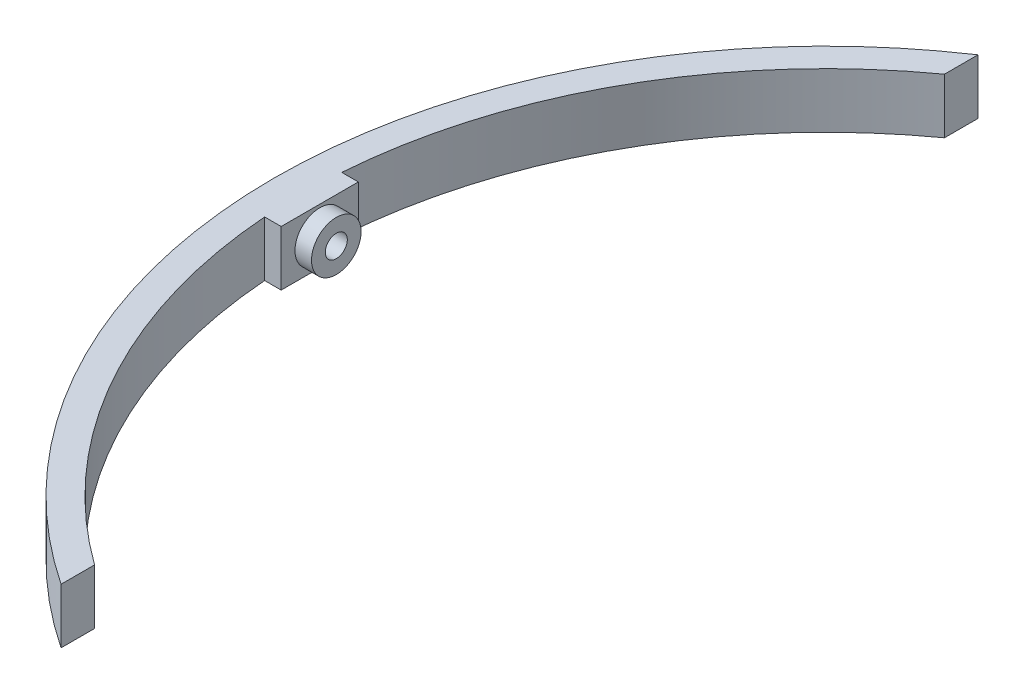
ISO-10303-21;
HEADER;
FILE_DESCRIPTION(('STEP AP214'),'2;1');
FILE_NAME('part.step','',(''),(''),'','','');
FILE_SCHEMA(('AUTOMOTIVE_DESIGN { 1 0 10303 214 1 1 1 1 }'));
ENDSEC;
DATA;
#1=APPLICATION_CONTEXT('core data for automotive mechanical design processes');
#2=APPLICATION_PROTOCOL_DEFINITION('international standard','automotive_design',2000,#1);
#3=PRODUCT_CONTEXT('',#1,'mechanical');
#4=PRODUCT('Part','Part','',(#3));
#5=PRODUCT_RELATED_PRODUCT_CATEGORY('part','',(#4));
#6=PRODUCT_DEFINITION_FORMATION('','',#4);
#7=PRODUCT_DEFINITION_CONTEXT('part definition',#1,'design');
#8=PRODUCT_DEFINITION('design','',#6,#7);
#9=PRODUCT_DEFINITION_SHAPE('','',#8);
#10=(LENGTH_UNIT() NAMED_UNIT(*) SI_UNIT(.MILLI.,.METRE.));
#11=(NAMED_UNIT(*) PLANE_ANGLE_UNIT() SI_UNIT($,.RADIAN.));
#12=(NAMED_UNIT(*) SI_UNIT($,.STERADIAN.) SOLID_ANGLE_UNIT());
#13=UNCERTAINTY_MEASURE_WITH_UNIT(LENGTH_MEASURE(1.E-05),#10,'distance_accuracy_value','');
#14=(GEOMETRIC_REPRESENTATION_CONTEXT(3) GLOBAL_UNCERTAINTY_ASSIGNED_CONTEXT((#13)) GLOBAL_UNIT_ASSIGNED_CONTEXT((#10,
#11,#12)) REPRESENTATION_CONTEXT('',''));
#15=CARTESIAN_POINT('',(0.,0.,0.));
#16=DIRECTION('',(0.,0.,1.));
#17=DIRECTION('',(1.,0.,0.));
#18=AXIS2_PLACEMENT_3D('',#15,#16,#17);
#19=CARTESIAN_POINT('',(-55.4978547592562,10.,1.89928480447165E-13));
#20=DIRECTION('',(-1.,0.,0.));
#21=DIRECTION('',(0.,0.,1.));
#22=AXIS2_PLACEMENT_3D('',#19,#20,#21);
#23=PLANE('',#22);
#24=DIRECTION('',(0.,0.,-1.));
#25=VECTOR('',#24,1.);
#26=CARTESIAN_POINT('',(-55.4978547592562,0.,1.89928480447165E-13));
#27=LINE('',#26,#25);
#28=CARTESIAN_POINT('',(-55.4978547592565,0.,-77.1037490471149));
#29=VERTEX_POINT('',#28);
#30=CARTESIAN_POINT('',(-55.4978547592565,0.,-83.1864659492184));
#31=VERTEX_POINT('',#30);
#32=EDGE_CURVE('E139',#29,#31,#27,.T.);
#33=ORIENTED_EDGE('',*,*,#32,.T.);
#34=DIRECTION('',(0.,-1.,0.));
#35=VECTOR('',#34,1.);
#36=CARTESIAN_POINT('',(-55.4978547592565,10.,-83.1864659492184));
#37=LINE('',#36,#35);
#38=CARTESIAN_POINT('',(-55.4978547592565,10.,-83.1864659492184));
#39=VERTEX_POINT('',#38);
#40=EDGE_CURVE('E11',#39,#31,#37,.T.);
#41=ORIENTED_EDGE('',*,*,#40,.F.);
#42=DIRECTION('',(0.,0.,-1.));
#43=VECTOR('',#42,1.);
#44=CARTESIAN_POINT('',(-55.4978547592562,10.,1.89928480447165E-13));
#45=LINE('',#44,#43);
#46=CARTESIAN_POINT('',(-55.4978547592565,10.,-77.1037490471149));
#47=VERTEX_POINT('',#46);
#48=EDGE_CURVE('E181',#47,#39,#45,.T.);
#49=ORIENTED_EDGE('',*,*,#48,.F.);
#50=DIRECTION('',(0.,-1.,0.));
#51=VECTOR('',#50,1.);
#52=CARTESIAN_POINT('',(-55.4978547592565,10.,-77.1037490471149));
#53=LINE('',#52,#51);
#54=EDGE_CURVE('E57',#47,#29,#53,.T.);
#55=ORIENTED_EDGE('',*,*,#54,.T.);
#56=EDGE_LOOP('',(#33,#41,#49,#55));
#57=FACE_BOUND('',#56,.T.);
#58=ADVANCED_FACE('F37',(#57),#23,.F.);
#59=CARTESIAN_POINT('',(0.,10.,0.));
#60=DIRECTION('',(0.,-1.,0.));
#61=DIRECTION('',(0.,0.,-1.));
#62=AXIS2_PLACEMENT_3D('',#59,#60,#61);
#63=CYLINDRICAL_SURFACE('',#62,100.);
#64=CARTESIAN_POINT('',(-99.9799979995999,4.93843185790536,-2.));
#65=CARTESIAN_POINT('',(-99.9799982698419,5.05076068172667,-1.99999502240394));
#66=CARTESIAN_POINT('',(-99.9801893370478,5.16317066861373,-1.99050491791884));
#67=CARTESIAN_POINT('',(-99.980933161142,5.38489398588322,-1.95277916400145));
#68=CARTESIAN_POINT('',(-99.9814863518978,5.49420343733432,-1.92452102761263));
#69=CARTESIAN_POINT('',(-99.9828917319434,5.70648143654605,-1.85006471785642));
#70=CARTESIAN_POINT('',(-99.9837437768625,5.80945301782283,-1.80387520563155));
#71=CARTESIAN_POINT('',(-99.9856506714658,6.00615153215588,-1.69487942675772));
#72=CARTESIAN_POINT('',(-99.9867054711132,6.09988073746857,-1.63207725841575));
#73=CARTESIAN_POINT('',(-99.9888993778967,6.27548947907655,-1.49161691133507));
#74=CARTESIAN_POINT('',(-99.9900385043336,6.35736628982915,-1.41395532506972));
#75=CARTESIAN_POINT('',(-99.99227249967,6.50692349045564,-1.24598555948726));
#76=CARTESIAN_POINT('',(-99.9933673668192,6.57460331934753,-1.15567688066579));
#77=CARTESIAN_POINT('',(-99.9953894452024,6.69384575138355,-0.964971317487835));
#78=CARTESIAN_POINT('',(-99.9963166455109,6.74540730438949,-0.864573776384515));
#79=CARTESIAN_POINT('',(-99.9978987634117,6.83094246059414,-0.656545210406148));
#80=CARTESIAN_POINT('',(-99.9985536817932,6.86491611477051,-0.548914206497952));
#81=CARTESIAN_POINT('',(-99.9995173278264,6.91430683195332,-0.329489136582484));
#82=CARTESIAN_POINT('',(-99.9998261017557,6.92972637555369,-0.217695629142402));
#83=CARTESIAN_POINT('',(-100.000062804398,6.94157878728726,0.00689352704859634));
#84=CARTESIAN_POINT('',(-99.9999907341677,6.93801170809759,0.119689173018277));
#85=CARTESIAN_POINT('',(-99.9994739140815,6.91199428899621,0.343063906854101));
#86=CARTESIAN_POINT('',(-99.9990292174315,6.88954664496216,0.453643308860805));
#87=CARTESIAN_POINT('',(-99.9978173336819,6.82640946203065,0.669463815133953));
#88=CARTESIAN_POINT('',(-99.9970501460778,6.78571989459146,0.774704911047677));
#89=CARTESIAN_POINT('',(-99.9952796705791,6.68725081249892,0.976869953848879));
#90=CARTESIAN_POINT('',(-99.9942763656044,6.62947006142963,1.07379329835622));
#91=CARTESIAN_POINT('',(-99.9921467505696,6.49845975565231,1.25656487264779));
#92=CARTESIAN_POINT('',(-99.9910204404123,6.42523018872235,1.34241309367014));
#93=CARTESIAN_POINT('',(-99.988771541896,6.26538569848999,1.50061323725154));
#94=CARTESIAN_POINT('',(-99.9876489542238,6.17876843183127,1.57296279212821));
#95=CARTESIAN_POINT('',(-99.9855342617869,5.99461559334388,1.70209361481759));
#96=CARTESIAN_POINT('',(-99.984542157041,5.89708001994562,1.75887488039224));
#97=CARTESIAN_POINT('',(-99.982800303422,5.69385799413265,1.85525700707654));
#98=CARTESIAN_POINT('',(-99.9820505555717,5.58817150732039,1.89485779567842));
#99=CARTESIAN_POINT('',(-99.980877993721,5.37164834406293,1.95575332574448));
#100=CARTESIAN_POINT('',(-99.9804551793165,5.26081167398096,1.97704808982572));
#101=CARTESIAN_POINT('',(-99.9799842273733,5.03715501963541,2.00072418651934));
#102=CARTESIAN_POINT('',(-99.9799360249187,4.9243353823938,2.00310879604847));
#103=CARTESIAN_POINT('',(-99.9802195622767,4.69989730597005,1.98890542787048));
#104=CARTESIAN_POINT('',(-99.9805513019034,4.58827886619982,1.97231745945254));
#105=CARTESIAN_POINT('',(-99.9815572650848,4.36942079737754,1.92064252559219));
#106=CARTESIAN_POINT('',(-99.982231461139,4.26218081746664,1.88555704555678));
#107=CARTESIAN_POINT('',(-99.9838463069154,4.05511311046745,1.79788456206272));
#108=CARTESIAN_POINT('',(-99.9847869568569,3.95528538948176,1.74529754419501));
#109=CARTESIAN_POINT('',(-99.9868288231905,3.7658608849897,1.62410630713333));
#110=CARTESIAN_POINT('',(-99.987930061706,3.67626551418144,1.55549988023989));
#111=CARTESIAN_POINT('',(-99.9901688763643,3.50986319531867,1.40422056700083));
#112=CARTESIAN_POINT('',(-99.9913064525564,3.43305626463375,1.32154766155007));
#113=CARTESIAN_POINT('',(-99.9934898842362,3.29440022556757,1.1444681793408));
#114=CARTESIAN_POINT('',(-99.9945357267441,3.23255323176861,1.05005994664939));
#115=CARTESIAN_POINT('',(-99.9964176027347,3.12558718866972,0.852198282562373));
#116=CARTESIAN_POINT('',(-99.9972536365507,3.0804681127894,0.748744865539735));
#117=CARTESIAN_POINT('',(-99.9986215835068,3.00824235435881,0.535737506750117));
#118=CARTESIAN_POINT('',(-99.9991535198989,2.98113429461675,0.426184032111504));
#119=CARTESIAN_POINT('',(-99.9998533967979,2.94569553976452,0.204079671079044));
#120=CARTESIAN_POINT('',(-100.000021337082,2.93736485615105,0.0915287828500347));
#121=CARTESIAN_POINT('',(-99.9999742895284,2.93971753510286,-0.133354087517909));
#122=CARTESIAN_POINT('',(-99.9997593691577,2.95039754763293,-0.245686104733971));
#123=CARTESIAN_POINT('',(-99.9989709566956,2.99046160100077,-0.466962509354151));
#124=CARTESIAN_POINT('',(-99.9983974638874,3.01984567922613,-0.575906889986257));
#125=CARTESIAN_POINT('',(-99.9969565288161,3.09648367742199,-0.787317718640164));
#126=CARTESIAN_POINT('',(-99.9960890812426,3.14373792023284,-0.88978404959122));
#127=CARTESIAN_POINT('',(-99.9941580335277,3.25477259025659,-1.08532581547032));
#128=CARTESIAN_POINT('',(-99.993094440818,3.31855239137053,-1.17840160598942));
#129=CARTESIAN_POINT('',(-99.9908908438504,3.46083326374589,-1.35253293754856));
#130=CARTESIAN_POINT('',(-99.9897508342628,3.53933536251145,-1.43358763890071));
#131=CARTESIAN_POINT('',(-99.9875226701209,3.70885601971978,-1.5813886068478));
#132=CARTESIAN_POINT('',(-99.9864345285037,3.79987767905372,-1.64813131808283));
#133=CARTESIAN_POINT('',(-99.9844325356111,3.99187827692287,-1.76541898036808));
#134=CARTESIAN_POINT('',(-99.9835187810732,4.09286269523821,-1.81595495159942));
#135=CARTESIAN_POINT('',(-99.9819704984615,4.3018057598339,-1.89929702639395));
#136=CARTESIAN_POINT('',(-99.9813356366026,4.40975589086351,-1.93212433488003));
#137=CARTESIAN_POINT('',(-99.9805869341155,4.58839807058518,-1.97039008800139));
#138=CARTESIAN_POINT('',(-99.9803670386679,4.65792988588039,-1.98147989683575));
#139=CARTESIAN_POINT('',(-99.9800724868016,4.79777447679557,-1.9962864109389));
#140=CARTESIAN_POINT('',(-99.979997830364,4.86808725231457,-2.00000311716103));
#141=CARTESIAN_POINT('',(-99.9799979995999,4.93843185790536,-2.));
#142=B_SPLINE_CURVE_WITH_KNOTS('',3,(#64,#65,#66,#67,#68,#69,#70,#71,#72,#73,#74,#75,#76,#77,
#78,#79,#80,#81,#82,#83,#84,#85,#86,#87,#88,#89,#90,#91,#92,#93,#94,#95,#96,#97,#98,#99,#100,
#101,#102,#103,#104,#105,#106,#107,#108,#109,#110,#111,#112,#113,#114,#115,#116,#117,#118,#119,
#120,#121,#122,#123,#124,#125,#126,#127,#128,#129,#130,#131,#132,#133,#134,#135,#136,#137,#138,
#139,#140,#141),.UNSPECIFIED.,.T.,.F.,(4,2,2,2,2,2,2,2,2,2,2,2,2,2,2,2,2,2,2,2,2,2,2,2,2,2,2,2,
2,2,2,2,2,2,2,2,2,2,4),(0.,0.336729709690302,0.67386360237332,1.0108348561736,1.34772305728369,
1.68468860559217,2.02166746630894,2.3586682773049,2.69566811151544,3.03262288548701,
3.36957672460005,3.70648245963572,4.04338872180339,4.38031936251611,4.71725026978361,
5.05424021969529,5.39123021805182,5.72822163861269,6.06521264282034,6.40214524900713,
6.7390776902281,7.07598307885902,7.41288874486531,7.7498408686347,8.08679345005748,
8.42379363182413,8.76079327810065,9.0977671531173,9.43474123445049,9.77165594061521,
10.1085713202415,10.4454927868336,10.7824014904475,11.119333716477,11.4563495459129,
11.7935517874996,12.1303493509026,12.3412224008978,12.5520954236275),.UNSPECIFIED.);
#143=CARTESIAN_POINT('',(-99.9799979995999,4.93843185790536,-2.));
#144=VERTEX_POINT('',#143);
#145=EDGE_CURVE('E40',#144,#144,#142,.T.);
#146=ORIENTED_EDGE('',*,*,#145,.T.);
#147=EDGE_LOOP('',(#146));
#148=FACE_BOUND('',#147,.T.);
#149=CARTESIAN_POINT('',(0.,0.,0.));
#150=DIRECTION('',(0.,1.,0.));
#151=DIRECTION('',(0.,0.,1.));
#152=AXIS2_PLACEMENT_3D('',#149,#150,#151);
#153=CIRCLE('',#152,100.);
#154=CARTESIAN_POINT('',(-55.4978547592559,0.,83.1864659492188));
#155=VERTEX_POINT('',#154);
#156=EDGE_CURVE('E141',#31,#155,#153,.T.);
#157=ORIENTED_EDGE('',*,*,#156,.T.);
#158=DIRECTION('',(0.,-1.,0.));
#159=VECTOR('',#158,1.);
#160=CARTESIAN_POINT('',(-55.4978547592559,10.,83.1864659492188));
#161=LINE('',#160,#159);
#162=CARTESIAN_POINT('',(-55.4978547592559,10.,83.1864659492188));
#163=VERTEX_POINT('',#162);
#164=EDGE_CURVE('E49',#163,#155,#161,.T.);
#165=ORIENTED_EDGE('',*,*,#164,.F.);
#166=CARTESIAN_POINT('',(0.,10.,0.));
#167=DIRECTION('',(0.,1.,0.));
#168=DIRECTION('',(0.,0.,1.));
#169=AXIS2_PLACEMENT_3D('',#166,#167,#168);
#170=CIRCLE('',#169,100.);
#171=EDGE_CURVE('E95',#39,#163,#170,.T.);
#172=ORIENTED_EDGE('',*,*,#171,.F.);
#173=ORIENTED_EDGE('',*,*,#40,.T.);
#174=EDGE_LOOP('',(#157,#165,#172,#173));
#175=FACE_BOUND('',#174,.T.);
#176=ADVANCED_FACE('F195',(#148,#175),#63,.T.);
#177=CARTESIAN_POINT('',(-55.4978547592562,10.,1.89928480447164E-13));
#178=DIRECTION('',(-1.,0.,0.));
#179=DIRECTION('',(0.,0.,1.));
#180=AXIS2_PLACEMENT_3D('',#177,#178,#179);
#181=PLANE('',#180);
#182=DIRECTION('',(0.,0.,-1.));
#183=VECTOR('',#182,1.);
#184=CARTESIAN_POINT('',(-55.4978547592562,0.,1.89928480447164E-13));
#185=LINE('',#184,#183);
#186=CARTESIAN_POINT('',(-55.4978547592559,0.,77.1037490471153));
#187=VERTEX_POINT('',#186);
#188=EDGE_CURVE('E144',#155,#187,#185,.T.);
#189=ORIENTED_EDGE('',*,*,#188,.T.);
#190=DIRECTION('',(0.,-1.,0.));
#191=VECTOR('',#190,1.);
#192=CARTESIAN_POINT('',(-55.4978547592559,10.,77.1037490471153));
#193=LINE('',#192,#191);
#194=CARTESIAN_POINT('',(-55.4978547592559,10.,77.1037490471153));
#195=VERTEX_POINT('',#194);
#196=EDGE_CURVE('E162',#195,#187,#193,.T.);
#197=ORIENTED_EDGE('',*,*,#196,.F.);
#198=DIRECTION('',(0.,0.,-1.));
#199=VECTOR('',#198,1.);
#200=CARTESIAN_POINT('',(-55.4978547592562,10.,1.89928480447164E-13));
#201=LINE('',#200,#199);
#202=EDGE_CURVE('E170',#163,#195,#201,.T.);
#203=ORIENTED_EDGE('',*,*,#202,.F.);
#204=ORIENTED_EDGE('',*,*,#164,.T.);
#205=EDGE_LOOP('',(#189,#197,#203,#204));
#206=FACE_BOUND('',#205,.T.);
#207=ADVANCED_FACE('F168',(#206),#181,.F.);
#208=CARTESIAN_POINT('',(0.,10.,0.));
#209=DIRECTION('',(0.,-1.,0.));
#210=DIRECTION('',(0.,0.,-1.));
#211=AXIS2_PLACEMENT_3D('',#208,#209,#210);
#212=CYLINDRICAL_SURFACE('',#211,95.);
#213=CARTESIAN_POINT('',(0.,0.,0.));
#214=DIRECTION('',(0.,1.,0.));
#215=DIRECTION('',(0.,0.,1.));
#216=AXIS2_PLACEMENT_3D('',#213,#214,#215);
#217=CIRCLE('',#216,95.);
#218=CARTESIAN_POINT('',(-94.7414030143944,0.,7.00475230569287));
#219=VERTEX_POINT('',#218);
#220=EDGE_CURVE('E147',#219,#187,#217,.T.);
#221=ORIENTED_EDGE('',*,*,#220,.F.);
#222=DIRECTION('',(0.,-1.,0.));
#223=VECTOR('',#222,1.);
#224=CARTESIAN_POINT('',(-94.7414030143944,10.,7.00475230569287));
#225=LINE('',#224,#223);
#226=CARTESIAN_POINT('',(-94.7414030143944,10.,7.00475230569287));
#227=VERTEX_POINT('',#226);
#228=EDGE_CURVE('E160',#227,#219,#225,.T.);
#229=ORIENTED_EDGE('',*,*,#228,.F.);
#230=CARTESIAN_POINT('',(0.,10.,0.));
#231=DIRECTION('',(0.,1.,0.));
#232=DIRECTION('',(0.,0.,1.));
#233=AXIS2_PLACEMENT_3D('',#230,#231,#232);
#234=CIRCLE('',#233,95.);
#235=EDGE_CURVE('E136',#227,#195,#234,.T.);
#236=ORIENTED_EDGE('',*,*,#235,.T.);
#237=ORIENTED_EDGE('',*,*,#196,.T.);
#238=EDGE_LOOP('',(#221,#229,#236,#237));
#239=FACE_BOUND('',#238,.T.);
#240=ADVANCED_FACE('F176',(#239),#212,.F.);
#241=CARTESIAN_POINT('',(0.,10.,7.00475230569287));
#242=DIRECTION('',(0.,0.,1.));
#243=DIRECTION('',(1.,0.,0.));
#244=AXIS2_PLACEMENT_3D('',#241,#242,#243);
#245=PLANE('',#244);
#246=DIRECTION('',(-1.,0.,0.));
#247=VECTOR('',#246,1.);
#248=CARTESIAN_POINT('',(0.,0.,7.00475230569287));
#249=LINE('',#248,#247);
#250=CARTESIAN_POINT('',(-91.7421052631579,0.,7.00475230569287));
#251=VERTEX_POINT('',#250);
#252=EDGE_CURVE('E150',#251,#219,#249,.T.);
#253=ORIENTED_EDGE('',*,*,#252,.F.);
#254=DIRECTION('',(0.,-1.,0.));
#255=VECTOR('',#254,1.);
#256=CARTESIAN_POINT('',(-91.7421052631579,10.,7.00475230569287));
#257=LINE('',#256,#255);
#258=CARTESIAN_POINT('',(-91.7421052631579,10.,7.00475230569287));
#259=VERTEX_POINT('',#258);
#260=EDGE_CURVE('E120',#259,#251,#257,.T.);
#261=ORIENTED_EDGE('',*,*,#260,.F.);
#262=DIRECTION('',(-1.,0.,0.));
#263=VECTOR('',#262,1.);
#264=CARTESIAN_POINT('',(0.,10.,7.00475230569287));
#265=LINE('',#264,#263);
#266=EDGE_CURVE('E130',#259,#227,#265,.T.);
#267=ORIENTED_EDGE('',*,*,#266,.T.);
#268=ORIENTED_EDGE('',*,*,#228,.T.);
#269=EDGE_LOOP('',(#253,#261,#267,#268));
#270=FACE_BOUND('',#269,.T.);
#271=ADVANCED_FACE('F225',(#270),#245,.T.);
#272=CARTESIAN_POINT('',(-91.7421052631579,10.,0.));
#273=DIRECTION('',(1.,0.,0.));
#274=DIRECTION('',(0.,0.,-1.));
#275=AXIS2_PLACEMENT_3D('',#272,#273,#274);
#276=PLANE('',#275);
#277=CARTESIAN_POINT('',(-91.7421052631579,4.93843185790536,0.));
#278=DIRECTION('',(1.,0.,0.));
#279=DIRECTION('',(0.,0.,-1.));
#280=AXIS2_PLACEMENT_3D('',#277,#278,#279);
#281=CIRCLE('',#280,4.5);
#282=CARTESIAN_POINT('',(-91.7421052631579,4.93843185790536,-4.5));
#283=VERTEX_POINT('',#282);
#284=EDGE_CURVE('E183',#283,#283,#281,.T.);
#285=ORIENTED_EDGE('',*,*,#284,.F.);
#286=EDGE_LOOP('',(#285));
#287=FACE_BOUND('',#286,.T.);
#288=DIRECTION('',(0.,0.,1.));
#289=VECTOR('',#288,1.);
#290=CARTESIAN_POINT('',(-91.7421052631579,0.,0.));
#291=LINE('',#290,#289);
#292=CARTESIAN_POINT('',(-91.7421052631579,0.,-6.99524769430713));
#293=VERTEX_POINT('',#292);
#294=EDGE_CURVE('E116',#293,#251,#291,.T.);
#295=ORIENTED_EDGE('',*,*,#294,.F.);
#296=DIRECTION('',(0.,-1.,0.));
#297=VECTOR('',#296,1.);
#298=CARTESIAN_POINT('',(-91.7421052631579,10.,-6.99524769430713));
#299=LINE('',#298,#297);
#300=CARTESIAN_POINT('',(-91.7421052631579,10.,-6.99524769430713));
#301=VERTEX_POINT('',#300);
#302=EDGE_CURVE('E111',#301,#293,#299,.T.);
#303=ORIENTED_EDGE('',*,*,#302,.F.);
#304=DIRECTION('',(0.,0.,1.));
#305=VECTOR('',#304,1.);
#306=CARTESIAN_POINT('',(-91.7421052631579,10.,0.));
#307=LINE('',#306,#305);
#308=EDGE_CURVE('E114',#301,#259,#307,.T.);
#309=ORIENTED_EDGE('',*,*,#308,.T.);
#310=ORIENTED_EDGE('',*,*,#260,.T.);
#311=EDGE_LOOP('',(#295,#303,#309,#310));
#312=FACE_BOUND('',#311,.T.);
#313=ADVANCED_FACE('F113',(#287,#312),#276,.T.);
#314=CARTESIAN_POINT('',(0.,10.,-6.99524769430713));
#315=DIRECTION('',(0.,0.,-1.));
#316=DIRECTION('',(-1.,0.,0.));
#317=AXIS2_PLACEMENT_3D('',#314,#315,#316);
#318=PLANE('',#317);
#319=DIRECTION('',(1.,0.,0.));
#320=VECTOR('',#319,1.);
#321=CARTESIAN_POINT('',(0.,0.,-6.99524769430713));
#322=LINE('',#321,#320);
#323=CARTESIAN_POINT('',(-94.7421052631579,0.,-6.99524769430713));
#324=VERTEX_POINT('',#323);
#325=EDGE_CURVE('E155',#324,#293,#322,.T.);
#326=ORIENTED_EDGE('',*,*,#325,.F.);
#327=DIRECTION('',(0.,-1.,0.));
#328=VECTOR('',#327,1.);
#329=CARTESIAN_POINT('',(-94.7421052631579,10.,-6.99524769430713));
#330=LINE('',#329,#328);
#331=CARTESIAN_POINT('',(-94.7421052631579,10.,-6.99524769430713));
#332=VERTEX_POINT('',#331);
#333=EDGE_CURVE('E83',#332,#324,#330,.T.);
#334=ORIENTED_EDGE('',*,*,#333,.F.);
#335=DIRECTION('',(1.,0.,0.));
#336=VECTOR('',#335,1.);
#337=CARTESIAN_POINT('',(0.,10.,-6.99524769430713));
#338=LINE('',#337,#336);
#339=EDGE_CURVE('E127',#332,#301,#338,.T.);
#340=ORIENTED_EDGE('',*,*,#339,.T.);
#341=ORIENTED_EDGE('',*,*,#302,.T.);
#342=EDGE_LOOP('',(#326,#334,#340,#341));
#343=FACE_BOUND('',#342,.T.);
#344=ADVANCED_FACE('F132',(#343),#318,.T.);
#345=EDGE_CURVE('E151',#29,#324,#217,.T.);
#346=ORIENTED_EDGE('',*,*,#345,.F.);
#347=ORIENTED_EDGE('',*,*,#54,.F.);
#348=EDGE_CURVE('E133',#47,#332,#234,.T.);
#349=ORIENTED_EDGE('',*,*,#348,.T.);
#350=ORIENTED_EDGE('',*,*,#333,.T.);
#351=EDGE_LOOP('',(#346,#347,#349,#350));
#352=FACE_BOUND('',#351,.T.);
#353=ADVANCED_FACE('F214',(#352),#212,.F.);
#354=CARTESIAN_POINT('',(0.,10.,0.));
#355=DIRECTION('',(0.,1.,0.));
#356=DIRECTION('',(0.,0.,1.));
#357=AXIS2_PLACEMENT_3D('',#354,#355,#356);
#358=PLANE('',#357);
#359=ORIENTED_EDGE('',*,*,#48,.T.);
#360=ORIENTED_EDGE('',*,*,#171,.T.);
#361=ORIENTED_EDGE('',*,*,#202,.T.);
#362=ORIENTED_EDGE('',*,*,#235,.F.);
#363=ORIENTED_EDGE('',*,*,#266,.F.);
#364=ORIENTED_EDGE('',*,*,#308,.F.);
#365=ORIENTED_EDGE('',*,*,#339,.F.);
#366=ORIENTED_EDGE('',*,*,#348,.F.);
#367=EDGE_LOOP('',(#359,#360,#361,#362,#363,#364,#365,#366));
#368=FACE_BOUND('',#367,.T.);
#369=ADVANCED_FACE('F125',(#368),#358,.T.);
#370=CARTESIAN_POINT('',(0.,0.,0.));
#371=DIRECTION('',(0.,1.,0.));
#372=DIRECTION('',(0.,0.,1.));
#373=AXIS2_PLACEMENT_3D('',#370,#371,#372);
#374=PLANE('',#373);
#375=ORIENTED_EDGE('',*,*,#32,.F.);
#376=ORIENTED_EDGE('',*,*,#345,.T.);
#377=ORIENTED_EDGE('',*,*,#325,.T.);
#378=ORIENTED_EDGE('',*,*,#294,.T.);
#379=ORIENTED_EDGE('',*,*,#252,.T.);
#380=ORIENTED_EDGE('',*,*,#220,.T.);
#381=ORIENTED_EDGE('',*,*,#188,.F.);
#382=ORIENTED_EDGE('',*,*,#156,.F.);
#383=EDGE_LOOP('',(#375,#376,#377,#378,#379,#380,#381,#382));
#384=FACE_BOUND('',#383,.T.);
#385=ADVANCED_FACE('F172',(#384),#374,.F.);
#386=CARTESIAN_POINT('',(-88.7421052631579,4.93843185790536,0.));
#387=DIRECTION('',(1.,0.,0.));
#388=DIRECTION('',(0.,0.,-1.));
#389=AXIS2_PLACEMENT_3D('',#386,#387,#388);
#390=PLANE('',#389);
#391=CARTESIAN_POINT('',(-88.7421052631579,4.93843185790536,0.));
#392=DIRECTION('',(1.,0.,0.));
#393=DIRECTION('',(0.,0.,-1.));
#394=AXIS2_PLACEMENT_3D('',#391,#392,#393);
#395=CIRCLE('',#394,4.5);
#396=CARTESIAN_POINT('',(-88.7421052631579,4.93843185790536,-4.5));
#397=VERTEX_POINT('',#396);
#398=EDGE_CURVE('E142',#397,#397,#395,.T.);
#399=ORIENTED_EDGE('',*,*,#398,.T.);
#400=EDGE_LOOP('',(#399));
#401=FACE_BOUND('',#400,.T.);
#402=CARTESIAN_POINT('',(-88.7421052631579,4.93843185790536,0.));
#403=DIRECTION('',(1.,0.,0.));
#404=DIRECTION('',(0.,0.,-1.));
#405=AXIS2_PLACEMENT_3D('',#402,#403,#404);
#406=CIRCLE('',#405,2.);
#407=CARTESIAN_POINT('',(-88.7421052631579,4.93843185790536,-2.));
#408=VERTEX_POINT('',#407);
#409=EDGE_CURVE('E186',#408,#408,#406,.T.);
#410=ORIENTED_EDGE('',*,*,#409,.F.);
#411=EDGE_LOOP('',(#410));
#412=FACE_BOUND('',#411,.T.);
#413=ADVANCED_FACE('F204',(#401,#412),#390,.T.);
#414=CARTESIAN_POINT('',(-88.7421052631579,4.93843185790536,0.));
#415=DIRECTION('',(-1.,0.,0.));
#416=DIRECTION('',(0.,0.,1.));
#417=AXIS2_PLACEMENT_3D('',#414,#415,#416);
#418=CYLINDRICAL_SURFACE('',#417,4.5);
#419=ORIENTED_EDGE('',*,*,#398,.F.);
#420=EDGE_LOOP('',(#419));
#421=FACE_BOUND('',#420,.T.);
#422=ORIENTED_EDGE('',*,*,#284,.T.);
#423=EDGE_LOOP('',(#422));
#424=FACE_BOUND('',#423,.T.);
#425=ADVANCED_FACE('F199',(#421,#424),#418,.T.);
#426=CARTESIAN_POINT('',(-88.7421052631579,4.93843185790536,0.));
#427=DIRECTION('',(-1.,0.,0.));
#428=DIRECTION('',(0.,0.,1.));
#429=AXIS2_PLACEMENT_3D('',#426,#427,#428);
#430=CYLINDRICAL_SURFACE('',#429,2.);
#431=ORIENTED_EDGE('',*,*,#409,.T.);
#432=EDGE_LOOP('',(#431));
#433=FACE_BOUND('',#432,.T.);
#434=ORIENTED_EDGE('',*,*,#145,.F.);
#435=EDGE_LOOP('',(#434));
#436=FACE_BOUND('',#435,.T.);
#437=ADVANCED_FACE('F197',(#433,#436),#430,.F.);
#438=CLOSED_SHELL('',(#58,#176,#207,#240,#271,#313,#344,#353,#369,#385,#413,#425,#437));
#439=MANIFOLD_SOLID_BREP('B2',#438);
#440=ADVANCED_BREP_SHAPE_REPRESENTATION('',(#18,#439),#14);
#441=SHAPE_DEFINITION_REPRESENTATION(#9,#440);
ENDSEC;
END-ISO-10303-21;
